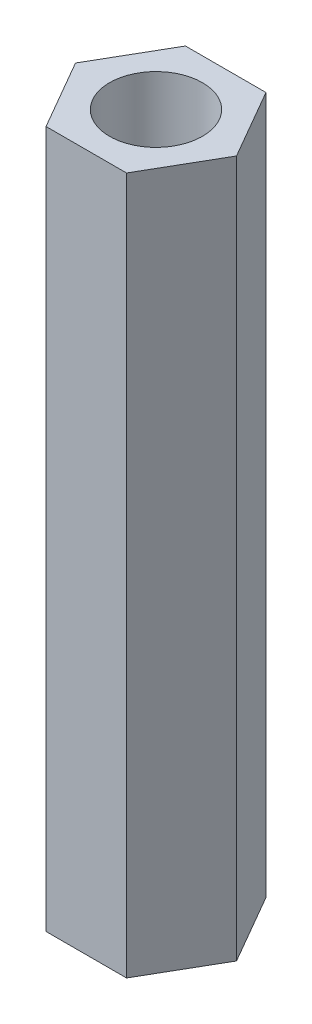
ISO-10303-21;
HEADER;
FILE_DESCRIPTION(('STEP AP214'),'2;1');
FILE_NAME('part.step','',(''),(''),'','','');
FILE_SCHEMA(('AUTOMOTIVE_DESIGN { 1 0 10303 214 1 1 1 1 }'));
ENDSEC;
DATA;
#1=APPLICATION_CONTEXT('core data for automotive mechanical design processes');
#2=APPLICATION_PROTOCOL_DEFINITION('international standard','automotive_design',2000,#1);
#3=PRODUCT_CONTEXT('',#1,'mechanical');
#4=PRODUCT('Part','Part','',(#3));
#5=PRODUCT_RELATED_PRODUCT_CATEGORY('part','',(#4));
#6=PRODUCT_DEFINITION_FORMATION('','',#4);
#7=PRODUCT_DEFINITION_CONTEXT('part definition',#1,'design');
#8=PRODUCT_DEFINITION('design','',#6,#7);
#9=PRODUCT_DEFINITION_SHAPE('','',#8);
#10=(LENGTH_UNIT() NAMED_UNIT(*) SI_UNIT(.MILLI.,.METRE.));
#11=(NAMED_UNIT(*) PLANE_ANGLE_UNIT() SI_UNIT($,.RADIAN.));
#12=(NAMED_UNIT(*) SI_UNIT($,.STERADIAN.) SOLID_ANGLE_UNIT());
#13=UNCERTAINTY_MEASURE_WITH_UNIT(LENGTH_MEASURE(1.E-05),#10,'distance_accuracy_value','');
#14=(GEOMETRIC_REPRESENTATION_CONTEXT(3) GLOBAL_UNCERTAINTY_ASSIGNED_CONTEXT((#13)) GLOBAL_UNIT_ASSIGNED_CONTEXT((#10,
#11,#12)) REPRESENTATION_CONTEXT('',''));
#15=CARTESIAN_POINT('',(0.,0.,0.));
#16=DIRECTION('',(0.,0.,1.));
#17=DIRECTION('',(1.,0.,0.));
#18=AXIS2_PLACEMENT_3D('',#15,#16,#17);
#19=CARTESIAN_POINT('',(-3.46410161513775,30.,0.));
#20=DIRECTION('',(0.86602540378444,0.,0.499999999999998));
#21=DIRECTION('',(0.499999999999998,0.,-0.86602540378444));
#22=AXIS2_PLACEMENT_3D('',#19,#20,#21);
#23=PLANE('',#22);
#24=DIRECTION('',(-0.499999999999998,0.,0.86602540378444));
#25=VECTOR('',#24,1.);
#26=CARTESIAN_POINT('',(-3.46410161513775,0.,0.));
#27=LINE('',#26,#25);
#28=CARTESIAN_POINT('',(-1.73205080756888,0.,-3.));
#29=VERTEX_POINT('',#28);
#30=CARTESIAN_POINT('',(-3.46410161513775,0.,0.));
#31=VERTEX_POINT('',#30);
#32=EDGE_CURVE('E128',#29,#31,#27,.T.);
#33=ORIENTED_EDGE('',*,*,#32,.T.);
#34=DIRECTION('',(0.,-1.,0.));
#35=VECTOR('',#34,1.);
#36=CARTESIAN_POINT('',(-3.46410161513775,30.,0.));
#37=LINE('',#36,#35);
#38=CARTESIAN_POINT('',(-3.46410161513775,30.,0.));
#39=VERTEX_POINT('',#38);
#40=EDGE_CURVE('E11',#39,#31,#37,.T.);
#41=ORIENTED_EDGE('',*,*,#40,.F.);
#42=DIRECTION('',(-0.499999999999998,0.,0.86602540378444));
#43=VECTOR('',#42,1.);
#44=CARTESIAN_POINT('',(-3.46410161513775,30.,0.));
#45=LINE('',#44,#43);
#46=CARTESIAN_POINT('',(-1.73205080756888,30.,-3.));
#47=VERTEX_POINT('',#46);
#48=EDGE_CURVE('E145',#47,#39,#45,.T.);
#49=ORIENTED_EDGE('',*,*,#48,.F.);
#50=DIRECTION('',(0.,-1.,0.));
#51=VECTOR('',#50,1.);
#52=CARTESIAN_POINT('',(-1.73205080756888,30.,-3.));
#53=LINE('',#52,#51);
#54=EDGE_CURVE('E124',#47,#29,#53,.T.);
#55=ORIENTED_EDGE('',*,*,#54,.T.);
#56=EDGE_LOOP('',(#33,#41,#49,#55));
#57=FACE_BOUND('',#56,.T.);
#58=ADVANCED_FACE('F39',(#57),#23,.F.);
#59=CARTESIAN_POINT('',(-1.73205080756888,30.,3.));
#60=DIRECTION('',(0.86602540378444,0.,-0.499999999999998));
#61=DIRECTION('',(-0.499999999999998,0.,-0.86602540378444));
#62=AXIS2_PLACEMENT_3D('',#59,#60,#61);
#63=PLANE('',#62);
#64=DIRECTION('',(0.499999999999998,0.,0.86602540378444));
#65=VECTOR('',#64,1.);
#66=CARTESIAN_POINT('',(-1.73205080756888,0.,3.));
#67=LINE('',#66,#65);
#68=CARTESIAN_POINT('',(-1.73205080756888,0.,3.));
#69=VERTEX_POINT('',#68);
#70=EDGE_CURVE('E132',#31,#69,#67,.T.);
#71=ORIENTED_EDGE('',*,*,#70,.T.);
#72=DIRECTION('',(0.,-1.,0.));
#73=VECTOR('',#72,1.);
#74=CARTESIAN_POINT('',(-1.73205080756888,30.,3.));
#75=LINE('',#74,#73);
#76=CARTESIAN_POINT('',(-1.73205080756888,30.,3.));
#77=VERTEX_POINT('',#76);
#78=EDGE_CURVE('E48',#77,#69,#75,.T.);
#79=ORIENTED_EDGE('',*,*,#78,.F.);
#80=DIRECTION('',(0.499999999999998,0.,0.86602540378444));
#81=VECTOR('',#80,1.);
#82=CARTESIAN_POINT('',(-1.73205080756888,30.,3.));
#83=LINE('',#82,#81);
#84=EDGE_CURVE('E93',#39,#77,#83,.T.);
#85=ORIENTED_EDGE('',*,*,#84,.F.);
#86=ORIENTED_EDGE('',*,*,#40,.T.);
#87=EDGE_LOOP('',(#71,#79,#85,#86));
#88=FACE_BOUND('',#87,.T.);
#89=ADVANCED_FACE('F174',(#88),#63,.F.);
#90=CARTESIAN_POINT('',(1.73205080756888,30.,3.));
#91=DIRECTION('',(0.,0.,-1.));
#92=DIRECTION('',(-1.,0.,0.));
#93=AXIS2_PLACEMENT_3D('',#90,#91,#92);
#94=PLANE('',#93);
#95=DIRECTION('',(1.,0.,0.));
#96=VECTOR('',#95,1.);
#97=CARTESIAN_POINT('',(1.73205080756888,0.,3.));
#98=LINE('',#97,#96);
#99=CARTESIAN_POINT('',(1.73205080756888,0.,3.));
#100=VERTEX_POINT('',#99);
#101=EDGE_CURVE('E136',#69,#100,#98,.T.);
#102=ORIENTED_EDGE('',*,*,#101,.T.);
#103=DIRECTION('',(0.,-1.,0.));
#104=VECTOR('',#103,1.);
#105=CARTESIAN_POINT('',(1.73205080756888,30.,3.));
#106=LINE('',#105,#104);
#107=CARTESIAN_POINT('',(1.73205080756888,30.,3.));
#108=VERTEX_POINT('',#107);
#109=EDGE_CURVE('E117',#108,#100,#106,.T.);
#110=ORIENTED_EDGE('',*,*,#109,.F.);
#111=DIRECTION('',(1.,0.,0.));
#112=VECTOR('',#111,1.);
#113=CARTESIAN_POINT('',(1.73205080756888,30.,3.));
#114=LINE('',#113,#112);
#115=EDGE_CURVE('E106',#77,#108,#114,.T.);
#116=ORIENTED_EDGE('',*,*,#115,.F.);
#117=ORIENTED_EDGE('',*,*,#78,.T.);
#118=EDGE_LOOP('',(#102,#110,#116,#117));
#119=FACE_BOUND('',#118,.T.);
#120=ADVANCED_FACE('F155',(#119),#94,.F.);
#121=CARTESIAN_POINT('',(3.46410161513775,30.,0.));
#122=DIRECTION('',(-0.86602540378444,0.,-0.499999999999998));
#123=DIRECTION('',(-0.499999999999998,0.,0.86602540378444));
#124=AXIS2_PLACEMENT_3D('',#121,#122,#123);
#125=PLANE('',#124);
#126=DIRECTION('',(0.499999999999998,0.,-0.86602540378444));
#127=VECTOR('',#126,1.);
#128=CARTESIAN_POINT('',(3.46410161513775,0.,0.));
#129=LINE('',#128,#127);
#130=CARTESIAN_POINT('',(3.46410161513775,0.,0.));
#131=VERTEX_POINT('',#130);
#132=EDGE_CURVE('E115',#100,#131,#129,.T.);
#133=ORIENTED_EDGE('',*,*,#132,.T.);
#134=DIRECTION('',(0.,-1.,0.));
#135=VECTOR('',#134,1.);
#136=CARTESIAN_POINT('',(3.46410161513775,30.,0.));
#137=LINE('',#136,#135);
#138=CARTESIAN_POINT('',(3.46410161513775,30.,0.));
#139=VERTEX_POINT('',#138);
#140=EDGE_CURVE('E112',#139,#131,#137,.T.);
#141=ORIENTED_EDGE('',*,*,#140,.F.);
#142=DIRECTION('',(0.499999999999998,0.,-0.86602540378444));
#143=VECTOR('',#142,1.);
#144=CARTESIAN_POINT('',(3.46410161513775,30.,0.));
#145=LINE('',#144,#143);
#146=EDGE_CURVE('E100',#108,#139,#145,.T.);
#147=ORIENTED_EDGE('',*,*,#146,.F.);
#148=ORIENTED_EDGE('',*,*,#109,.T.);
#149=EDGE_LOOP('',(#133,#141,#147,#148));
#150=FACE_BOUND('',#149,.T.);
#151=ADVANCED_FACE('F113',(#150),#125,.F.);
#152=CARTESIAN_POINT('',(1.73205080756888,30.,-3.));
#153=DIRECTION('',(-0.86602540378444,0.,0.499999999999998));
#154=DIRECTION('',(0.499999999999998,0.,0.86602540378444));
#155=AXIS2_PLACEMENT_3D('',#152,#153,#154);
#156=PLANE('',#155);
#157=DIRECTION('',(-0.499999999999998,0.,-0.86602540378444));
#158=VECTOR('',#157,1.);
#159=CARTESIAN_POINT('',(1.73205080756888,0.,-3.));
#160=LINE('',#159,#158);
#161=CARTESIAN_POINT('',(1.73205080756888,0.,-3.));
#162=VERTEX_POINT('',#161);
#163=EDGE_CURVE('E79',#131,#162,#160,.T.);
#164=ORIENTED_EDGE('',*,*,#163,.T.);
#165=DIRECTION('',(0.,-1.,0.));
#166=VECTOR('',#165,1.);
#167=CARTESIAN_POINT('',(1.73205080756888,30.,-3.));
#168=LINE('',#167,#166);
#169=CARTESIAN_POINT('',(1.73205080756888,30.,-3.));
#170=VERTEX_POINT('',#169);
#171=EDGE_CURVE('E118',#170,#162,#168,.T.);
#172=ORIENTED_EDGE('',*,*,#171,.F.);
#173=DIRECTION('',(-0.499999999999998,0.,-0.86602540378444));
#174=VECTOR('',#173,1.);
#175=CARTESIAN_POINT('',(1.73205080756888,30.,-3.));
#176=LINE('',#175,#174);
#177=EDGE_CURVE('E104',#139,#170,#176,.T.);
#178=ORIENTED_EDGE('',*,*,#177,.F.);
#179=ORIENTED_EDGE('',*,*,#140,.T.);
#180=EDGE_LOOP('',(#164,#172,#178,#179));
#181=FACE_BOUND('',#180,.T.);
#182=ADVANCED_FACE('F120',(#181),#156,.F.);
#183=CARTESIAN_POINT('',(-1.73205080756888,30.,-3.));
#184=DIRECTION('',(0.,0.,1.));
#185=DIRECTION('',(1.,0.,0.));
#186=AXIS2_PLACEMENT_3D('',#183,#184,#185);
#187=PLANE('',#186);
#188=DIRECTION('',(-1.,0.,0.));
#189=VECTOR('',#188,1.);
#190=CARTESIAN_POINT('',(-1.73205080756888,0.,-3.));
#191=LINE('',#190,#189);
#192=EDGE_CURVE('E85',#162,#29,#191,.T.);
#193=ORIENTED_EDGE('',*,*,#192,.T.);
#194=ORIENTED_EDGE('',*,*,#54,.F.);
#195=DIRECTION('',(-1.,0.,0.));
#196=VECTOR('',#195,1.);
#197=CARTESIAN_POINT('',(-1.73205080756888,30.,-3.));
#198=LINE('',#197,#196);
#199=EDGE_CURVE('E56',#170,#47,#198,.T.);
#200=ORIENTED_EDGE('',*,*,#199,.F.);
#201=ORIENTED_EDGE('',*,*,#171,.T.);
#202=EDGE_LOOP('',(#193,#194,#200,#201));
#203=FACE_BOUND('',#202,.T.);
#204=ADVANCED_FACE('F162',(#203),#187,.F.);
#205=CARTESIAN_POINT('',(0.,30.,0.));
#206=DIRECTION('',(0.,-1.,0.));
#207=DIRECTION('',(0.,0.,-1.));
#208=AXIS2_PLACEMENT_3D('',#205,#206,#207);
#209=PLANE('',#208);
#210=CARTESIAN_POINT('',(0.,30.,0.));
#211=DIRECTION('',(0.,-1.,0.));
#212=DIRECTION('',(0.,0.,-1.));
#213=AXIS2_PLACEMENT_3D('',#210,#211,#212);
#214=CIRCLE('',#213,2.);
#215=CARTESIAN_POINT('',(0.,30.,-2.));
#216=VERTEX_POINT('',#215);
#217=EDGE_CURVE('E133',#216,#216,#214,.F.);
#218=ORIENTED_EDGE('',*,*,#217,.F.);
#219=EDGE_LOOP('',(#218));
#220=FACE_BOUND('',#219,.T.);
#221=ORIENTED_EDGE('',*,*,#48,.T.);
#222=ORIENTED_EDGE('',*,*,#84,.T.);
#223=ORIENTED_EDGE('',*,*,#115,.T.);
#224=ORIENTED_EDGE('',*,*,#146,.T.);
#225=ORIENTED_EDGE('',*,*,#177,.T.);
#226=ORIENTED_EDGE('',*,*,#199,.T.);
#227=EDGE_LOOP('',(#221,#222,#223,#224,#225,#226));
#228=FACE_BOUND('',#227,.T.);
#229=ADVANCED_FACE('F102',(#220,#228),#209,.F.);
#230=CARTESIAN_POINT('',(0.,0.,0.));
#231=DIRECTION('',(0.,-1.,0.));
#232=DIRECTION('',(0.,0.,-1.));
#233=AXIS2_PLACEMENT_3D('',#230,#231,#232);
#234=PLANE('',#233);
#235=CARTESIAN_POINT('',(0.,0.,0.));
#236=DIRECTION('',(0.,-1.,0.));
#237=DIRECTION('',(0.,0.,-1.));
#238=AXIS2_PLACEMENT_3D('',#235,#236,#237);
#239=CIRCLE('',#238,2.);
#240=CARTESIAN_POINT('',(0.,0.,-2.));
#241=VERTEX_POINT('',#240);
#242=EDGE_CURVE('E227',#241,#241,#239,.F.);
#243=ORIENTED_EDGE('',*,*,#242,.T.);
#244=EDGE_LOOP('',(#243));
#245=FACE_BOUND('',#244,.T.);
#246=ORIENTED_EDGE('',*,*,#32,.F.);
#247=ORIENTED_EDGE('',*,*,#192,.F.);
#248=ORIENTED_EDGE('',*,*,#163,.F.);
#249=ORIENTED_EDGE('',*,*,#132,.F.);
#250=ORIENTED_EDGE('',*,*,#101,.F.);
#251=ORIENTED_EDGE('',*,*,#70,.F.);
#252=EDGE_LOOP('',(#246,#247,#248,#249,#250,#251));
#253=FACE_BOUND('',#252,.T.);
#254=ADVANCED_FACE('F158',(#245,#253),#234,.T.);
#255=CARTESIAN_POINT('',(0.,30.000012,0.));
#256=DIRECTION('',(0.,-1.,0.));
#257=DIRECTION('',(0.,0.,-1.));
#258=AXIS2_PLACEMENT_3D('',#255,#256,#257);
#259=CYLINDRICAL_SURFACE('',#258,2.);
#260=ORIENTED_EDGE('',*,*,#242,.F.);
#261=EDGE_LOOP('',(#260));
#262=FACE_BOUND('',#261,.T.);
#263=ORIENTED_EDGE('',*,*,#217,.T.);
#264=EDGE_LOOP('',(#263));
#265=FACE_BOUND('',#264,.T.);
#266=ADVANCED_FACE('F211',(#262,#265),#259,.F.);
#267=CLOSED_SHELL('',(#58,#89,#120,#151,#182,#204,#229,#254,#266));
#268=MANIFOLD_SOLID_BREP('B2',#267);
#269=ADVANCED_BREP_SHAPE_REPRESENTATION('',(#18,#268),#14);
#270=SHAPE_DEFINITION_REPRESENTATION(#9,#269);
ENDSEC;
END-ISO-10303-21;
